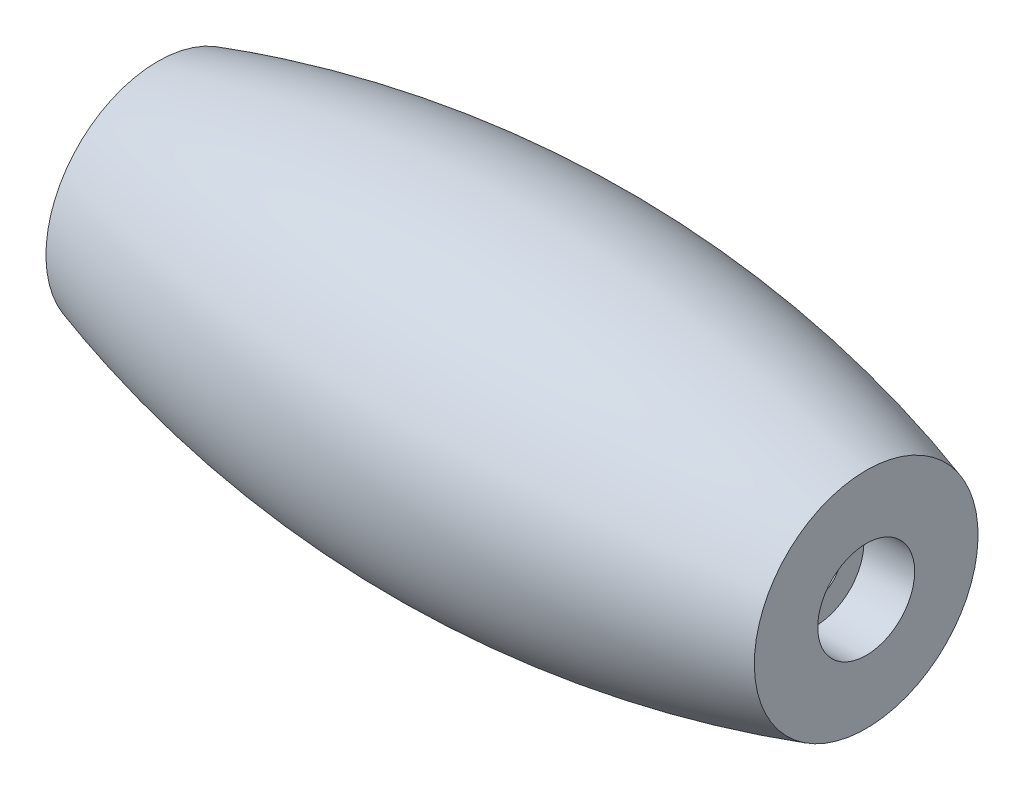
ISO-10303-21;
HEADER;
FILE_DESCRIPTION(('STEP AP214'),'2;1');
FILE_NAME('part.step','',(''),(''),'','','');
FILE_SCHEMA(('AUTOMOTIVE_DESIGN { 1 0 10303 214 1 1 1 1 }'));
ENDSEC;
DATA;
#1=APPLICATION_CONTEXT('core data for automotive mechanical design processes');
#2=APPLICATION_PROTOCOL_DEFINITION('international standard','automotive_design',2000,#1);
#3=PRODUCT_CONTEXT('',#1,'mechanical');
#4=PRODUCT('Part','Part','',(#3));
#5=PRODUCT_RELATED_PRODUCT_CATEGORY('part','',(#4));
#6=PRODUCT_DEFINITION_FORMATION('','',#4);
#7=PRODUCT_DEFINITION_CONTEXT('part definition',#1,'design');
#8=PRODUCT_DEFINITION('design','',#6,#7);
#9=PRODUCT_DEFINITION_SHAPE('','',#8);
#10=(LENGTH_UNIT() NAMED_UNIT(*) SI_UNIT(.MILLI.,.METRE.));
#11=(NAMED_UNIT(*) PLANE_ANGLE_UNIT() SI_UNIT($,.RADIAN.));
#12=(NAMED_UNIT(*) SI_UNIT($,.STERADIAN.) SOLID_ANGLE_UNIT());
#13=UNCERTAINTY_MEASURE_WITH_UNIT(LENGTH_MEASURE(1.E-05),#10,'distance_accuracy_value','');
#14=(GEOMETRIC_REPRESENTATION_CONTEXT(3) GLOBAL_UNCERTAINTY_ASSIGNED_CONTEXT((#13)) GLOBAL_UNIT_ASSIGNED_CONTEXT((#10,
#11,#12)) REPRESENTATION_CONTEXT('',''));
#15=CARTESIAN_POINT('',(0.,0.,0.));
#16=DIRECTION('',(0.,0.,1.));
#17=DIRECTION('',(1.,0.,0.));
#18=AXIS2_PLACEMENT_3D('',#15,#16,#17);
#19=CARTESIAN_POINT('',(0.,0.,0.));
#20=DIRECTION('',(-1.,0.,0.));
#21=DIRECTION('',(0.,-1.,0.));
#22=AXIS2_PLACEMENT_3D('',#19,#20,#21);
#23=PLANE('',#22);
#24=CARTESIAN_POINT('',(0.,0.,0.));
#25=DIRECTION('',(-1.,0.,0.));
#26=DIRECTION('',(0.,0.,1.));
#27=AXIS2_PLACEMENT_3D('',#24,#25,#26);
#28=CIRCLE('',#27,3.25);
#29=CARTESIAN_POINT('',(0.,0.,3.25));
#30=VERTEX_POINT('',#29);
#31=EDGE_CURVE('E121',#30,#30,#28,.T.);
#32=ORIENTED_EDGE('',*,*,#31,.F.);
#33=EDGE_LOOP('',(#32));
#34=FACE_BOUND('',#33,.T.);
#35=CARTESIAN_POINT('',(0.,0.,0.));
#36=DIRECTION('',(1.,0.,0.));
#37=DIRECTION('',(0.,1.,0.));
#38=AXIS2_PLACEMENT_3D('',#35,#36,#37);
#39=CIRCLE('',#38,7.5);
#40=CARTESIAN_POINT('',(0.,7.5,0.));
#41=VERTEX_POINT('',#40);
#42=EDGE_CURVE('E11',#41,#41,#39,.T.);
#43=ORIENTED_EDGE('',*,*,#42,.F.);
#44=EDGE_LOOP('',(#43));
#45=FACE_BOUND('',#44,.T.);
#46=ADVANCED_FACE('F34',(#34,#45),#23,.T.);
#47=CARTESIAN_POINT('',(23.75,0.,0.));
#48=DIRECTION('',(1.,0.,0.));
#49=DIRECTION('',(0.,1.,0.));
#50=AXIS2_PLACEMENT_3D('',#47,#48,#49);
#51=DEGENERATE_TOROIDAL_SURFACE('',#50,68.8933079529876,80.,.F.);
#52=ORIENTED_EDGE('',*,*,#42,.T.);
#53=EDGE_LOOP('',(#52));
#54=FACE_BOUND('',#53,.T.);
#55=CARTESIAN_POINT('',(47.5,0.,0.));
#56=DIRECTION('',(1.,0.,0.));
#57=DIRECTION('',(0.,1.,0.));
#58=AXIS2_PLACEMENT_3D('',#55,#56,#57);
#59=CIRCLE('',#58,7.50000000000001);
#60=CARTESIAN_POINT('',(47.5,7.50000000000001,0.));
#61=VERTEX_POINT('',#60);
#62=EDGE_CURVE('E41',#61,#61,#59,.T.);
#63=ORIENTED_EDGE('',*,*,#62,.F.);
#64=EDGE_LOOP('',(#63));
#65=FACE_BOUND('',#64,.T.);
#66=ADVANCED_FACE('F80',(#54,#65),#51,.F.);
#67=CARTESIAN_POINT('',(47.5,7.5,0.));
#68=DIRECTION('',(1.,0.,0.));
#69=DIRECTION('',(0.,1.,0.));
#70=AXIS2_PLACEMENT_3D('',#67,#68,#69);
#71=PLANE('',#70);
#72=CARTESIAN_POINT('',(47.5,0.,0.));
#73=DIRECTION('',(1.,0.,0.));
#74=DIRECTION('',(0.,0.,-1.));
#75=AXIS2_PLACEMENT_3D('',#72,#73,#74);
#76=CIRCLE('',#75,3.25);
#77=CARTESIAN_POINT('',(47.5,0.,-3.25));
#78=VERTEX_POINT('',#77);
#79=EDGE_CURVE('E57',#78,#78,#76,.T.);
#80=ORIENTED_EDGE('',*,*,#79,.F.);
#81=EDGE_LOOP('',(#80));
#82=FACE_BOUND('',#81,.T.);
#83=ORIENTED_EDGE('',*,*,#62,.T.);
#84=EDGE_LOOP('',(#83));
#85=FACE_BOUND('',#84,.T.);
#86=ADVANCED_FACE('F78',(#82,#85),#71,.T.);
#87=CARTESIAN_POINT('',(35.93,0.,0.));
#88=DIRECTION('',(1.,0.,0.));
#89=DIRECTION('',(0.,0.,-1.));
#90=AXIS2_PLACEMENT_3D('',#87,#88,#89);
#91=CONICAL_SURFACE('',#90,1.7,1.02974425867665);
#92=CARTESIAN_POINT('',(34.9085369476532,0.,0.));
#93=VERTEX_POINT('',#92);
#94=VERTEX_LOOP('',#93);
#95=FACE_BOUND('',#94,.T.);
#96=CARTESIAN_POINT('',(35.93,0.,0.));
#97=DIRECTION('',(1.,0.,0.));
#98=DIRECTION('',(0.,0.,-1.));
#99=AXIS2_PLACEMENT_3D('',#96,#97,#98);
#100=CIRCLE('',#99,1.7);
#101=CARTESIAN_POINT('',(35.93,0.,-1.7));
#102=VERTEX_POINT('',#101);
#103=EDGE_CURVE('E73',#102,#102,#100,.T.);
#104=ORIENTED_EDGE('',*,*,#103,.T.);
#105=EDGE_LOOP('',(#104));
#106=FACE_BOUND('',#105,.T.);
#107=ADVANCED_FACE('F87',(#95,#106),#91,.F.);
#108=CARTESIAN_POINT('',(47.5,0.,0.));
#109=DIRECTION('',(1.,0.,0.));
#110=DIRECTION('',(0.,0.,-1.));
#111=AXIS2_PLACEMENT_3D('',#108,#109,#110);
#112=CYLINDRICAL_SURFACE('',#111,1.7);
#113=ORIENTED_EDGE('',*,*,#103,.F.);
#114=EDGE_LOOP('',(#113));
#115=FACE_BOUND('',#114,.T.);
#116=CARTESIAN_POINT('',(44.1,0.,0.));
#117=DIRECTION('',(1.,0.,0.));
#118=DIRECTION('',(0.,0.,-1.));
#119=AXIS2_PLACEMENT_3D('',#116,#117,#118);
#120=CIRCLE('',#119,1.7);
#121=CARTESIAN_POINT('',(44.1,0.,-1.7));
#122=VERTEX_POINT('',#121);
#123=EDGE_CURVE('E70',#122,#122,#120,.T.);
#124=ORIENTED_EDGE('',*,*,#123,.T.);
#125=EDGE_LOOP('',(#124));
#126=FACE_BOUND('',#125,.T.);
#127=ADVANCED_FACE('F94',(#115,#126),#112,.F.);
#128=CARTESIAN_POINT('',(44.1,1.7,0.));
#129=DIRECTION('',(-1.,0.,0.));
#130=DIRECTION('',(0.,0.,1.));
#131=AXIS2_PLACEMENT_3D('',#128,#129,#130);
#132=PLANE('',#131);
#133=ORIENTED_EDGE('',*,*,#123,.F.);
#134=EDGE_LOOP('',(#133));
#135=FACE_BOUND('',#134,.T.);
#136=CARTESIAN_POINT('',(44.1,0.,0.));
#137=DIRECTION('',(1.,0.,0.));
#138=DIRECTION('',(0.,0.,-1.));
#139=AXIS2_PLACEMENT_3D('',#136,#137,#138);
#140=CIRCLE('',#139,3.25);
#141=CARTESIAN_POINT('',(44.1,0.,-3.25));
#142=VERTEX_POINT('',#141);
#143=EDGE_CURVE('E61',#142,#142,#140,.T.);
#144=ORIENTED_EDGE('',*,*,#143,.T.);
#145=EDGE_LOOP('',(#144));
#146=FACE_BOUND('',#145,.T.);
#147=ADVANCED_FACE('F97',(#135,#146),#132,.F.);
#148=CARTESIAN_POINT('',(47.5,0.,0.));
#149=DIRECTION('',(1.,0.,0.));
#150=DIRECTION('',(0.,0.,-1.));
#151=AXIS2_PLACEMENT_3D('',#148,#149,#150);
#152=CYLINDRICAL_SURFACE('',#151,3.25);
#153=ORIENTED_EDGE('',*,*,#143,.F.);
#154=EDGE_LOOP('',(#153));
#155=FACE_BOUND('',#154,.T.);
#156=ORIENTED_EDGE('',*,*,#79,.T.);
#157=EDGE_LOOP('',(#156));
#158=FACE_BOUND('',#157,.T.);
#159=ADVANCED_FACE('F51',(#155,#158),#152,.F.);
#160=CARTESIAN_POINT('',(11.57,0.,0.));
#161=DIRECTION('',(-1.,0.,0.));
#162=DIRECTION('',(0.,0.,1.));
#163=AXIS2_PLACEMENT_3D('',#160,#161,#162);
#164=CONICAL_SURFACE('',#163,1.7,1.02974425867665);
#165=CARTESIAN_POINT('',(12.5914630523468,0.,0.));
#166=VERTEX_POINT('',#165);
#167=VERTEX_LOOP('',#166);
#168=FACE_BOUND('',#167,.T.);
#169=CARTESIAN_POINT('',(11.57,0.,0.));
#170=DIRECTION('',(-1.,0.,0.));
#171=DIRECTION('',(0.,0.,1.));
#172=AXIS2_PLACEMENT_3D('',#169,#170,#171);
#173=CIRCLE('',#172,1.7);
#174=CARTESIAN_POINT('',(11.57,0.,1.7));
#175=VERTEX_POINT('',#174);
#176=EDGE_CURVE('E55',#175,#175,#173,.T.);
#177=ORIENTED_EDGE('',*,*,#176,.T.);
#178=EDGE_LOOP('',(#177));
#179=FACE_BOUND('',#178,.T.);
#180=ADVANCED_FACE('F47',(#168,#179),#164,.F.);
#181=CARTESIAN_POINT('',(0.,0.,0.));
#182=DIRECTION('',(-1.,0.,0.));
#183=DIRECTION('',(0.,0.,1.));
#184=AXIS2_PLACEMENT_3D('',#181,#182,#183);
#185=CYLINDRICAL_SURFACE('',#184,1.7);
#186=ORIENTED_EDGE('',*,*,#176,.F.);
#187=EDGE_LOOP('',(#186));
#188=FACE_BOUND('',#187,.T.);
#189=CARTESIAN_POINT('',(3.4,0.,0.));
#190=DIRECTION('',(-1.,0.,0.));
#191=DIRECTION('',(0.,0.,1.));
#192=AXIS2_PLACEMENT_3D('',#189,#190,#191);
#193=CIRCLE('',#192,1.7);
#194=CARTESIAN_POINT('',(3.4,0.,1.7));
#195=VERTEX_POINT('',#194);
#196=EDGE_CURVE('E58',#195,#195,#193,.T.);
#197=ORIENTED_EDGE('',*,*,#196,.T.);
#198=EDGE_LOOP('',(#197));
#199=FACE_BOUND('',#198,.T.);
#200=ADVANCED_FACE('F50',(#188,#199),#185,.F.);
#201=CARTESIAN_POINT('',(3.4,1.7,0.));
#202=DIRECTION('',(1.,0.,0.));
#203=DIRECTION('',(0.,0.,-1.));
#204=AXIS2_PLACEMENT_3D('',#201,#202,#203);
#205=PLANE('',#204);
#206=ORIENTED_EDGE('',*,*,#196,.F.);
#207=EDGE_LOOP('',(#206));
#208=FACE_BOUND('',#207,.T.);
#209=CARTESIAN_POINT('',(3.4,0.,0.));
#210=DIRECTION('',(-1.,0.,0.));
#211=DIRECTION('',(0.,0.,1.));
#212=AXIS2_PLACEMENT_3D('',#209,#210,#211);
#213=CIRCLE('',#212,3.25);
#214=CARTESIAN_POINT('',(3.4,0.,3.25));
#215=VERTEX_POINT('',#214);
#216=EDGE_CURVE('E64',#215,#215,#213,.T.);
#217=ORIENTED_EDGE('',*,*,#216,.T.);
#218=EDGE_LOOP('',(#217));
#219=FACE_BOUND('',#218,.T.);
#220=ADVANCED_FACE('F107',(#208,#219),#205,.F.);
#221=CARTESIAN_POINT('',(0.,0.,0.));
#222=DIRECTION('',(-1.,0.,0.));
#223=DIRECTION('',(0.,0.,1.));
#224=AXIS2_PLACEMENT_3D('',#221,#222,#223);
#225=CYLINDRICAL_SURFACE('',#224,3.25);
#226=ORIENTED_EDGE('',*,*,#216,.F.);
#227=EDGE_LOOP('',(#226));
#228=FACE_BOUND('',#227,.T.);
#229=ORIENTED_EDGE('',*,*,#31,.T.);
#230=EDGE_LOOP('',(#229));
#231=FACE_BOUND('',#230,.T.);
#232=ADVANCED_FACE('F110',(#228,#231),#225,.F.);
#233=CLOSED_SHELL('',(#46,#66,#86,#107,#127,#147,#159,#180,#200,#220,#232));
#234=MANIFOLD_SOLID_BREP('B2',#233);
#235=ADVANCED_BREP_SHAPE_REPRESENTATION('',(#18,#234),#14);
#236=SHAPE_DEFINITION_REPRESENTATION(#9,#235);
ENDSEC;
END-ISO-10303-21;
